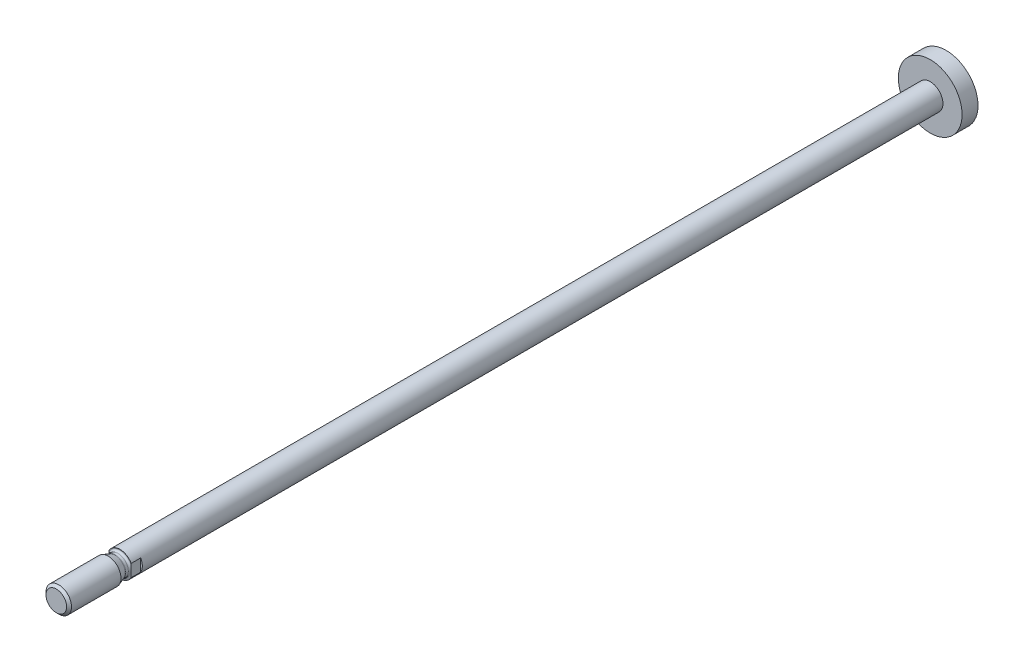
ISO-10303-21;
HEADER;
FILE_DESCRIPTION(('STEP AP214'),'2;1');
FILE_NAME('part.step','',(''),(''),'','','');
FILE_SCHEMA(('AUTOMOTIVE_DESIGN { 1 0 10303 214 1 1 1 1 }'));
ENDSEC;
DATA;
#1=APPLICATION_CONTEXT('core data for automotive mechanical design processes');
#2=APPLICATION_PROTOCOL_DEFINITION('international standard','automotive_design',2000,#1);
#3=PRODUCT_CONTEXT('',#1,'mechanical');
#4=PRODUCT('Part','Part','',(#3));
#5=PRODUCT_RELATED_PRODUCT_CATEGORY('part','',(#4));
#6=PRODUCT_DEFINITION_FORMATION('','',#4);
#7=PRODUCT_DEFINITION_CONTEXT('part definition',#1,'design');
#8=PRODUCT_DEFINITION('design','',#6,#7);
#9=PRODUCT_DEFINITION_SHAPE('','',#8);
#10=(LENGTH_UNIT() NAMED_UNIT(*) SI_UNIT(.MILLI.,.METRE.));
#11=(NAMED_UNIT(*) PLANE_ANGLE_UNIT() SI_UNIT($,.RADIAN.));
#12=(NAMED_UNIT(*) SI_UNIT($,.STERADIAN.) SOLID_ANGLE_UNIT());
#13=UNCERTAINTY_MEASURE_WITH_UNIT(LENGTH_MEASURE(1.E-05),#10,'distance_accuracy_value','');
#14=(GEOMETRIC_REPRESENTATION_CONTEXT(3) GLOBAL_UNCERTAINTY_ASSIGNED_CONTEXT((#13)) GLOBAL_UNIT_ASSIGNED_CONTEXT((#10,
#11,#12)) REPRESENTATION_CONTEXT('',''));
#15=CARTESIAN_POINT('',(0.,0.,0.));
#16=DIRECTION('',(0.,0.,1.));
#17=DIRECTION('',(1.,0.,0.));
#18=AXIS2_PLACEMENT_3D('',#15,#16,#17);
#19=CARTESIAN_POINT('',(0.,0.,4.));
#20=DIRECTION('',(0.,0.,-1.));
#21=DIRECTION('',(-1.,0.,0.));
#22=AXIS2_PLACEMENT_3D('',#19,#20,#21);
#23=PLANE('',#22);
#24=DIRECTION('',(0.,1.,0.));
#25=VECTOR('',#24,1.);
#26=CARTESIAN_POINT('',(-3.5,0.,4.));
#27=LINE('',#26,#25);
#28=CARTESIAN_POINT('',(-3.5,-1.93649167310371,4.));
#29=VERTEX_POINT('',#28);
#30=CARTESIAN_POINT('',(-3.5,-1.47986485869513,4.));
#31=VERTEX_POINT('',#30);
#32=EDGE_CURVE('E51',#29,#31,#27,.T.);
#33=ORIENTED_EDGE('',*,*,#32,.F.);
#34=CARTESIAN_POINT('',(0.,0.,4.));
#35=DIRECTION('',(0.,0.,1.));
#36=DIRECTION('',(1.,0.,0.));
#37=AXIS2_PLACEMENT_3D('',#34,#35,#36);
#38=CIRCLE('',#37,4.);
#39=CARTESIAN_POINT('',(3.5,-1.93649167310371,4.));
#40=VERTEX_POINT('',#39);
#41=EDGE_CURVE('E144',#29,#40,#38,.T.);
#42=ORIENTED_EDGE('',*,*,#41,.T.);
#43=DIRECTION('',(0.,-1.,0.));
#44=VECTOR('',#43,1.);
#45=CARTESIAN_POINT('',(3.5,0.,4.));
#46=LINE('',#45,#44);
#47=CARTESIAN_POINT('',(3.5,-1.47986485869513,3.99999999999992));
#48=VERTEX_POINT('',#47);
#49=EDGE_CURVE('E98',#48,#40,#46,.T.);
#50=ORIENTED_EDGE('',*,*,#49,.F.);
#51=CARTESIAN_POINT('',(0.,0.,4.));
#52=DIRECTION('',(0.,0.,1.));
#53=DIRECTION('',(1.,0.,0.));
#54=AXIS2_PLACEMENT_3D('',#51,#52,#53);
#55=CIRCLE('',#54,3.8000000000001);
#56=EDGE_CURVE('E146',#31,#48,#55,.T.);
#57=ORIENTED_EDGE('',*,*,#56,.F.);
#58=EDGE_LOOP('',(#33,#42,#50,#57));
#59=FACE_BOUND('',#58,.T.);
#60=ADVANCED_FACE('F37',(#59),#23,.F.);
#61=CARTESIAN_POINT('',(-3.5,1.47986485869513,3.99999999999992));
#62=VERTEX_POINT('',#61);
#63=CARTESIAN_POINT('',(-3.5,1.93649167310371,4.));
#64=VERTEX_POINT('',#63);
#65=EDGE_CURVE('E107',#62,#64,#27,.T.);
#66=ORIENTED_EDGE('',*,*,#65,.F.);
#67=CARTESIAN_POINT('',(3.5,1.47986485869513,4.));
#68=VERTEX_POINT('',#67);
#69=EDGE_CURVE('E147',#68,#62,#55,.T.);
#70=ORIENTED_EDGE('',*,*,#69,.F.);
#71=CARTESIAN_POINT('',(3.5,1.93649167310371,4.));
#72=VERTEX_POINT('',#71);
#73=EDGE_CURVE('E59',#72,#68,#46,.T.);
#74=ORIENTED_EDGE('',*,*,#73,.F.);
#75=EDGE_CURVE('E106',#72,#64,#38,.T.);
#76=ORIENTED_EDGE('',*,*,#75,.T.);
#77=EDGE_LOOP('',(#66,#70,#74,#76));
#78=FACE_BOUND('',#77,.T.);
#79=ADVANCED_FACE('F201',(#78),#23,.F.);
#80=CARTESIAN_POINT('',(0.,0.,-255.3));
#81=DIRECTION('',(0.,0.,1.));
#82=DIRECTION('',(1.,0.,0.));
#83=AXIS2_PLACEMENT_3D('',#80,#81,#82);
#84=CYLINDRICAL_SURFACE('',#83,4.);
#85=CARTESIAN_POINT('',(0.,0.,-250.3));
#86=DIRECTION('',(0.,0.,1.));
#87=DIRECTION('',(1.,0.,0.));
#88=AXIS2_PLACEMENT_3D('',#85,#86,#87);
#89=CIRCLE('',#88,4.);
#90=CARTESIAN_POINT('',(4.,0.,-250.3));
#91=VERTEX_POINT('',#90);
#92=EDGE_CURVE('E141',#91,#91,#89,.T.);
#93=ORIENTED_EDGE('',*,*,#92,.T.);
#94=EDGE_LOOP('',(#93));
#95=FACE_BOUND('',#94,.T.);
#96=DIRECTION('',(0.,0.,1.));
#97=VECTOR('',#96,1.);
#98=CARTESIAN_POINT('',(-3.5,-1.93649167310371,-255.3));
#99=LINE('',#98,#97);
#100=CARTESIAN_POINT('',(-3.5,-1.93649167310371,1.));
#101=VERTEX_POINT('',#100);
#102=EDGE_CURVE('E115',#101,#29,#99,.T.);
#103=ORIENTED_EDGE('',*,*,#102,.F.);
#104=CARTESIAN_POINT('',(0.,0.,1.));
#105=DIRECTION('',(0.,0.,1.));
#106=DIRECTION('',(1.,0.,0.));
#107=AXIS2_PLACEMENT_3D('',#104,#105,#106);
#108=CIRCLE('',#107,4.);
#109=CARTESIAN_POINT('',(-3.5,1.93649167310371,1.));
#110=VERTEX_POINT('',#109);
#111=EDGE_CURVE('E11',#110,#101,#108,.T.);
#112=ORIENTED_EDGE('',*,*,#111,.F.);
#113=DIRECTION('',(0.,0.,1.));
#114=VECTOR('',#113,1.);
#115=CARTESIAN_POINT('',(-3.5,1.93649167310371,-255.3));
#116=LINE('',#115,#114);
#117=EDGE_CURVE('E113',#64,#110,#116,.F.);
#118=ORIENTED_EDGE('',*,*,#117,.F.);
#119=ORIENTED_EDGE('',*,*,#75,.F.);
#120=DIRECTION('',(0.,0.,1.));
#121=VECTOR('',#120,1.);
#122=CARTESIAN_POINT('',(3.5,1.93649167310371,-255.3));
#123=LINE('',#122,#121);
#124=CARTESIAN_POINT('',(3.5,1.93649167310371,1.));
#125=VERTEX_POINT('',#124);
#126=EDGE_CURVE('E96',#125,#72,#123,.T.);
#127=ORIENTED_EDGE('',*,*,#126,.F.);
#128=CARTESIAN_POINT('',(3.5,-1.93649167310371,1.));
#129=VERTEX_POINT('',#128);
#130=EDGE_CURVE('E40',#129,#125,#108,.T.);
#131=ORIENTED_EDGE('',*,*,#130,.F.);
#132=DIRECTION('',(0.,0.,1.));
#133=VECTOR('',#132,1.);
#134=CARTESIAN_POINT('',(3.5,-1.93649167310371,-255.3));
#135=LINE('',#134,#133);
#136=EDGE_CURVE('E97',#40,#129,#135,.F.);
#137=ORIENTED_EDGE('',*,*,#136,.F.);
#138=ORIENTED_EDGE('',*,*,#41,.F.);
#139=EDGE_LOOP('',(#103,#112,#118,#119,#127,#131,#137,#138));
#140=FACE_BOUND('',#139,.T.);
#141=ADVANCED_FACE('F103',(#95,#140),#84,.T.);
#142=CARTESIAN_POINT('',(0.,0.,4.6000000000001));
#143=DIRECTION('',(0.,0.,1.));
#144=DIRECTION('',(1.,0.,0.));
#145=AXIS2_PLACEMENT_3D('',#142,#143,#144);
#146=TOROIDAL_SURFACE('',#145,3.8000000000001,0.600000000000099);
#147=CARTESIAN_POINT('',(0.,0.,4.6));
#148=DIRECTION('',(0.,0.,1.));
#149=DIRECTION('',(1.,0.,0.));
#150=AXIS2_PLACEMENT_3D('',#147,#148,#149);
#151=CIRCLE('',#150,3.2);
#152=CARTESIAN_POINT('',(3.2,0.,4.6));
#153=VERTEX_POINT('',#152);
#154=EDGE_CURVE('E132',#153,#153,#151,.T.);
#155=ORIENTED_EDGE('',*,*,#154,.F.);
#156=EDGE_LOOP('',(#155));
#157=FACE_BOUND('',#156,.T.);
#158=CARTESIAN_POINT('',(-3.5,0.,4.08038475772938));
#159=CARTESIAN_POINT('',(-3.5,0.0500062055653644,4.08038579524003));
#160=CARTESIAN_POINT('',(-3.5,0.10001186907905,4.07976142660828));
#161=CARTESIAN_POINT('',(-3.5,0.200008073579427,4.07732415974821));
#162=CARTESIAN_POINT('',(-3.5,0.249998606009498,4.07551091782565));
#163=CARTESIAN_POINT('',(-3.5,0.350023676666661,4.0708553451476));
#164=CARTESIAN_POINT('',(-3.5,0.400058122823757,4.06801109956585));
#165=CARTESIAN_POINT('',(-3.5,0.500067954430721,4.06154909714063));
#166=CARTESIAN_POINT('',(-3.5,0.550043347826766,4.05793146015032));
#167=CARTESIAN_POINT('',(-3.5,0.690839508563253,4.04708094798961));
#168=CARTESIAN_POINT('',(-3.5,0.781617050076563,4.03931230060361));
#169=CARTESIAN_POINT('',(-3.5,0.9632220149238,4.024401341373));
#170=CARTESIAN_POINT('',(-3.5,1.05404943604569,4.01725900370584));
#171=CARTESIAN_POINT('',(-3.5,1.2359337458161,4.00596554667804));
#172=CARTESIAN_POINT('',(-3.5,1.32699066193964,4.00181480438343));
#173=CARTESIAN_POINT('',(-3.5,1.50913050906379,3.99911696420226));
#174=CARTESIAN_POINT('',(-3.5,1.60021331380939,4.00056402453771));
#175=CARTESIAN_POINT('',(-3.5,1.7832512039485,4.01223826838346));
#176=CARTESIAN_POINT('',(-3.5,1.87520111900955,4.02258560378902));
#177=CARTESIAN_POINT('',(-3.5,2.01109807868235,4.04805353771768));
#178=CARTESIAN_POINT('',(-3.5,2.05597275422268,4.05817105079477));
#179=CARTESIAN_POINT('',(-3.5,2.1446015872334,4.08243134215497));
#180=CARTESIAN_POINT('',(-3.5,2.18835703510382,4.09656923395692));
#181=CARTESIAN_POINT('',(-3.5,2.26502423932735,4.12625619760487));
#182=CARTESIAN_POINT('',(-3.5,2.29828717281195,4.14088897580844));
#183=CARTESIAN_POINT('',(-3.5,2.36308366134456,4.17374487362841));
#184=CARTESIAN_POINT('',(-3.5,2.39461486317948,4.1919727313804));
#185=CARTESIAN_POINT('',(-3.5,2.45528633475527,4.2327718563323));
#186=CARTESIAN_POINT('',(-3.5,2.48439672100251,4.25538839857406));
#187=CARTESIAN_POINT('',(-3.5,2.53828325245288,4.30531204058377));
#188=CARTESIAN_POINT('',(-3.5,2.56307231252292,4.33260466298422));
#189=CARTESIAN_POINT('',(-3.5,2.59835539678092,4.38117119923997));
#190=CARTESIAN_POINT('',(-3.5,2.61077480767077,4.40104374871059));
#191=CARTESIAN_POINT('',(-3.5,2.63229473049418,4.44252572441527));
#192=CARTESIAN_POINT('',(-3.5,2.64139766596252,4.4641338682032));
#193=CARTESIAN_POINT('',(-3.5,2.6556780834849,4.50882581532605));
#194=CARTESIAN_POINT('',(-3.5,2.66082330977963,4.53192011572204));
#195=CARTESIAN_POINT('',(-3.5,2.66658722454624,4.57866774033149));
#196=CARTESIAN_POINT('',(-3.5,2.66720861100635,4.60232072290385));
#197=CARTESIAN_POINT('',(-3.5,2.66406334493496,4.64664399355305));
#198=CARTESIAN_POINT('',(-3.5,2.66078189261244,4.66735080097796));
#199=CARTESIAN_POINT('',(-3.5,2.65086769882215,4.70793958933708));
#200=CARTESIAN_POINT('',(-3.5,2.64423425840105,4.72782139730718));
#201=CARTESIAN_POINT('',(-3.5,2.62783818542989,4.76683694228269));
#202=CARTESIAN_POINT('',(-3.5,2.61799948146632,4.78593830149638));
#203=CARTESIAN_POINT('',(-3.5,2.5957864239932,4.8225893297694));
#204=CARTESIAN_POINT('',(-3.5,2.58341098566742,4.84013833036213));
#205=CARTESIAN_POINT('',(-3.5,2.54827666077279,4.88403391197271));
#206=CARTESIAN_POINT('',(-3.5,2.52385245228452,4.90904933157706));
#207=CARTESIAN_POINT('',(-3.5,2.4713802477796,4.95494570673838));
#208=CARTESIAN_POINT('',(-3.5,2.44332184293567,4.97581433256553));
#209=CARTESIAN_POINT('',(-3.5,2.36690919769617,5.02546583684508));
#210=CARTESIAN_POINT('',(-3.5,2.31664003371327,5.05127975894021));
#211=CARTESIAN_POINT('',(-3.5,2.21292774859494,5.09519868885441));
#212=CARTESIAN_POINT('',(-3.5,2.15947928807564,5.11329028588226));
#213=CARTESIAN_POINT('',(-3.5,2.05241854459677,5.14298422713627));
#214=CARTESIAN_POINT('',(-3.5,1.99885008338122,5.15474937556394));
#215=CARTESIAN_POINT('',(-3.5,1.89088555933464,5.17371645891197));
#216=CARTESIAN_POINT('',(-3.5,1.83648865462849,5.18091338377391));
#217=CARTESIAN_POINT('',(-3.5,1.72719420827212,5.19169636188153));
#218=CARTESIAN_POINT('',(-3.5,1.67229565989963,5.19527163434467));
#219=CARTESIAN_POINT('',(-3.5,1.56237784754192,5.19956192851468));
#220=CARTESIAN_POINT('',(-3.5,1.50735854591716,5.20027587383621));
#221=CARTESIAN_POINT('',(-3.5,1.32143089044828,5.19902509431349));
#222=CARTESIAN_POINT('',(-3.5,1.19058803810505,5.1920033327333));
#223=CARTESIAN_POINT('',(-3.5,0.929144323978893,5.17339442832176));
#224=CARTESIAN_POINT('',(-3.5,0.798544182549121,5.161800011167));
#225=CARTESIAN_POINT('',(-3.5,0.602747235241971,5.14602809613734));
#226=CARTESIAN_POINT('',(-3.5,0.537627510492783,5.14104900273235));
#227=CARTESIAN_POINT('',(-3.5,0.407306821786678,5.1323371224062));
#228=CARTESIAN_POINT('',(-3.5,0.342105863988336,5.1286042461649));
#229=CARTESIAN_POINT('',(-3.5,0.211728862091437,5.1229526202353));
#230=CARTESIAN_POINT('',(-3.5,0.146552955128154,5.1210308804655));
#231=CARTESIAN_POINT('',(-3.5,0.0161730194372509,5.11928917221939));
#232=CARTESIAN_POINT('',(-3.5,-0.0490310086083378,5.11946915535245));
#233=CARTESIAN_POINT('',(-3.5,-0.179475576502579,5.12190517622444));
#234=CARTESIAN_POINT('',(-3.5,-0.244716066981349,5.12416369265122));
#235=CARTESIAN_POINT('',(-3.5,-0.375115910587606,5.13040554579892));
#236=CARTESIAN_POINT('',(-3.5,-0.440275258610719,5.13438898602551));
#237=CARTESIAN_POINT('',(-3.5,-0.635895337566246,5.14807827632179));
#238=CARTESIAN_POINT('',(-3.5,-0.76621884732944,5.15951342405818));
#239=CARTESIAN_POINT('',(-3.5,-1.02713131334285,5.18073972163101));
#240=CARTESIAN_POINT('',(-3.5,-1.15772038871775,5.19052976890211));
#241=CARTESIAN_POINT('',(-3.5,-1.35378409785631,5.19852164600105));
#242=CARTESIAN_POINT('',(-3.5,-1.41909161309346,5.2000721709194));
#243=CARTESIAN_POINT('',(-3.5,-1.54969188303483,5.19992263560432));
#244=CARTESIAN_POINT('',(-3.5,-1.61498463760302,5.19822333879744));
#245=CARTESIAN_POINT('',(-3.5,-1.76029290673312,5.18951322581212));
#246=CARTESIAN_POINT('',(-3.5,-1.84025983788535,5.18137635704226));
#247=CARTESIAN_POINT('',(-3.5,-1.95903476517147,5.16210189637695));
#248=CARTESIAN_POINT('',(-3.5,-1.99841540324246,5.15450321251105));
#249=CARTESIAN_POINT('',(-3.5,-2.07652038986955,5.13650653853808));
#250=CARTESIAN_POINT('',(-3.5,-2.11524511477409,5.12611021577707));
#251=CARTESIAN_POINT('',(-3.5,-2.19864889359521,5.0998048910277));
#252=CARTESIAN_POINT('',(-3.5,-2.24312539757502,5.08323620538603));
#253=CARTESIAN_POINT('',(-3.5,-2.32958676042036,5.04443385186534));
#254=CARTESIAN_POINT('',(-3.5,-2.37157403081922,5.022205781053));
#255=CARTESIAN_POINT('',(-3.5,-2.43977528813279,4.97826900973618));
#256=CARTESIAN_POINT('',(-3.5,-2.46706045695041,4.95823818276675));
#257=CARTESIAN_POINT('',(-3.5,-2.51831793755153,4.91428859212922));
#258=CARTESIAN_POINT('',(-3.5,-2.54229604965639,4.89037680000235));
#259=CARTESIAN_POINT('',(-3.5,-2.57970363739195,4.84535217347594));
#260=CARTESIAN_POINT('',(-3.5,-2.59424612037896,4.82517000607983));
#261=CARTESIAN_POINT('',(-3.5,-2.61992505476884,4.78272143024207));
#262=CARTESIAN_POINT('',(-3.5,-2.63106349643882,4.76045624967719));
#263=CARTESIAN_POINT('',(-3.5,-2.64920025698533,4.7140036601898));
#264=CARTESIAN_POINT('',(-3.5,-2.65615513895816,4.68979894460471));
#265=CARTESIAN_POINT('',(-3.5,-2.66504809529779,4.64048613942947));
#266=CARTESIAN_POINT('',(-3.5,-2.66699167521719,4.61537907197386));
#267=CARTESIAN_POINT('',(-3.5,-2.66576972792539,4.56913838413921));
#268=CARTESIAN_POINT('',(-3.5,-2.66333713024049,4.54798188760978));
#269=CARTESIAN_POINT('',(-3.5,-2.65493122425014,4.50638930411087));
#270=CARTESIAN_POINT('',(-3.5,-2.6489573784939,4.4859533269926));
#271=CARTESIAN_POINT('',(-3.5,-2.63391040496586,4.44635032544822));
#272=CARTESIAN_POINT('',(-3.5,-2.62484735225162,4.42717941476791));
#273=CARTESIAN_POINT('',(-3.5,-2.60412982714912,4.39030840624931));
#274=CARTESIAN_POINT('',(-3.5,-2.59247439145874,4.37260885852133));
#275=CARTESIAN_POINT('',(-3.5,-2.55964651342061,4.32891810073296));
#276=CARTESIAN_POINT('',(-3.5,-2.53688962871665,4.30411605633953));
#277=CARTESIAN_POINT('',(-3.5,-2.48775025498198,4.25840323881892));
#278=CARTESIAN_POINT('',(-3.5,-2.46135776993871,4.2375035818933));
#279=CARTESIAN_POINT('',(-3.5,-2.38986954756856,4.18798307162582));
#280=CARTESIAN_POINT('',(-3.5,-2.34291429622141,4.16206577415089));
#281=CARTESIAN_POINT('',(-3.5,-2.24574558542675,4.11749887118979));
#282=CARTESIAN_POINT('',(-3.5,-2.19552624943271,4.09886282247383));
#283=CARTESIAN_POINT('',(-3.5,-2.09587462128469,4.06817578766957));
#284=CARTESIAN_POINT('',(-3.5,-2.04652620992952,4.05584474254379));
#285=CARTESIAN_POINT('',(-3.5,-1.94693895896851,4.0354159388682));
#286=CARTESIAN_POINT('',(-3.5,-1.89669924688715,4.02732259522156));
#287=CARTESIAN_POINT('',(-3.5,-1.74513146101115,4.00812320842939));
#288=CARTESIAN_POINT('',(-3.5,-1.64316995649346,4.00215511449531));
#289=CARTESIAN_POINT('',(-3.5,-1.41246700498561,3.99839333626015));
#290=CARTESIAN_POINT('',(-3.5,-1.28373629994329,4.00316287285656));
#291=CARTESIAN_POINT('',(-3.5,-1.02661753839385,4.01880990476259));
#292=CARTESIAN_POINT('',(-3.5,-0.898230000845064,4.0296939787844));
#293=CARTESIAN_POINT('',(-3.5,-0.705746127745405,4.04568170858882));
#294=CARTESIAN_POINT('',(-3.5,-0.641662853121003,4.05094963535158));
#295=CARTESIAN_POINT('',(-3.5,-0.513433811524688,4.06064102594273));
#296=CARTESIAN_POINT('',(-3.5,-0.449288049445188,4.06506455125933));
#297=CARTESIAN_POINT('',(-3.5,-0.32098353941607,4.07243012154035));
#298=CARTESIAN_POINT('',(-3.5,-0.256824896504214,4.07537391204972));
#299=CARTESIAN_POINT('',(-3.5,-0.128443871708583,4.07935057895739));
#300=CARTESIAN_POINT('',(-3.5,-0.0642214888377097,4.08038342528518));
#301=CARTESIAN_POINT('',(-3.5,0.,4.08038475772938));
#302=B_SPLINE_CURVE_WITH_KNOTS('',3,(#158,#159,#160,#161,#162,#163,#164,#165,#166,#167,#168,
#169,#170,#171,#172,#173,#174,#175,#176,#177,#178,#179,#180,#181,#182,#183,#184,#185,#186,#187,
#188,#189,#190,#191,#192,#193,#194,#195,#196,#197,#198,#199,#200,#201,#202,#203,#204,#205,#206,
#207,#208,#209,#210,#211,#212,#213,#214,#215,#216,#217,#218,#219,#220,#221,#222,#223,#224,#225,
#226,#227,#228,#229,#230,#231,#232,#233,#234,#235,#236,#237,#238,#239,#240,#241,#242,#243,#244,
#245,#246,#247,#248,#249,#250,#251,#252,#253,#254,#255,#256,#257,#258,#259,#260,#261,#262,#263,
#264,#265,#266,#267,#268,#269,#270,#271,#272,#273,#274,#275,#276,#277,#278,#279,#280,#281,#282,
#283,#284,#285,#286,#287,#288,#289,#290,#291,#292,#293,#294,#295,#296,#297,#298,#299,#300,#301),
.UNSPECIFIED.,.T.,.F.,(4,2,2,2,2,2,2,2,2,2,2,2,2,2,2,2,2,2,2,2,2,2,2,2,2,2,2,2,2,2,2,2,2,2,2,2,
2,2,2,2,2,2,2,2,2,2,2,2,2,2,2,2,2,2,2,2,2,2,2,2,2,2,2,2,2,2,2,2,2,2,2,4),(0.,0.150014048798422,
0.300071484653546,0.450409053935331,0.600723342136289,0.874049825720873,1.14736503484109,
1.42071468707779,1.69377915294987,1.97058884479861,2.10845216776641,2.2461486387614,
2.35499514952082,2.46398608488314,2.57416771557531,2.68401418736232,2.75406745328572,
2.8240694241867,2.89463604494047,2.96516057677686,3.02776088906933,3.09037426010844,
3.15459752456243,3.21884831114799,3.32313116232507,3.42771958650061,3.59629393435684,
3.76515985338398,3.92944239010749,4.09390478874738,4.25885532608726,4.42386790935157,
4.81662747336841,5.21001438834882,5.4059342565683,5.60184007960282,5.79742190395237,
5.99299922518425,6.18881007848093,6.38463268321895,6.77711538137523,7.16986008579766,
7.36577121673005,7.56163633117303,7.80230390131153,7.92254416345271,8.04271292251144,
8.18480424522089,8.32675558344215,8.42801297124486,8.5290904393555,8.60345225460728,
8.67777050861516,8.75284763934138,8.82784225307812,8.89141694017011,8.95500127838402,
9.01838019760285,9.08178270722154,9.1821864562108,9.28287198824411,9.44286612854139,
9.60315675421254,9.75552106026109,9.90804378754775,10.2137509318015,10.5998737561413,
10.9864128129893,11.1793105025674,11.372194140224,11.5648497087301,11.7575083088275),.UNSPECIFIED.);
#303=EDGE_CURVE('E94',#31,#62,#302,.T.);
#304=ORIENTED_EDGE('',*,*,#303,.F.);
#305=ORIENTED_EDGE('',*,*,#56,.T.);
#306=CARTESIAN_POINT('',(3.5,0.,4.08038475772938));
#307=CARTESIAN_POINT('',(3.5,-0.0500062055653644,4.08038579524003));
#308=CARTESIAN_POINT('',(3.5,-0.10001186907905,4.07976142660828));
#309=CARTESIAN_POINT('',(3.5,-0.200008073579427,4.07732415974821));
#310=CARTESIAN_POINT('',(3.5,-0.249998606009498,4.07551091782565));
#311=CARTESIAN_POINT('',(3.5,-0.350023676666661,4.0708553451476));
#312=CARTESIAN_POINT('',(3.5,-0.400058122823757,4.06801109956585));
#313=CARTESIAN_POINT('',(3.5,-0.500067954430721,4.06154909714063));
#314=CARTESIAN_POINT('',(3.5,-0.550043347826766,4.05793146015032));
#315=CARTESIAN_POINT('',(3.5,-0.690839508563253,4.04708094798961));
#316=CARTESIAN_POINT('',(3.5,-0.781617050076563,4.03931230060361));
#317=CARTESIAN_POINT('',(3.5,-0.9632220149238,4.024401341373));
#318=CARTESIAN_POINT('',(3.5,-1.05404943604569,4.01725900370584));
#319=CARTESIAN_POINT('',(3.5,-1.2359337458161,4.00596554667804));
#320=CARTESIAN_POINT('',(3.5,-1.32699066193964,4.00181480438343));
#321=CARTESIAN_POINT('',(3.5,-1.50913050906379,3.99911696420226));
#322=CARTESIAN_POINT('',(3.5,-1.60021331380939,4.00056402453771));
#323=CARTESIAN_POINT('',(3.5,-1.7832512039485,4.01223826838346));
#324=CARTESIAN_POINT('',(3.5,-1.87520111900955,4.02258560378902));
#325=CARTESIAN_POINT('',(3.5,-2.01109807868235,4.04805353771768));
#326=CARTESIAN_POINT('',(3.5,-2.05597275422268,4.05817105079477));
#327=CARTESIAN_POINT('',(3.5,-2.1446015872334,4.08243134215497));
#328=CARTESIAN_POINT('',(3.5,-2.18835703510382,4.09656923395692));
#329=CARTESIAN_POINT('',(3.5,-2.26502423932735,4.12625619760487));
#330=CARTESIAN_POINT('',(3.5,-2.29828717281195,4.14088897580844));
#331=CARTESIAN_POINT('',(3.5,-2.36308366134456,4.17374487362841));
#332=CARTESIAN_POINT('',(3.5,-2.39461486317948,4.1919727313804));
#333=CARTESIAN_POINT('',(3.5,-2.45528633475527,4.2327718563323));
#334=CARTESIAN_POINT('',(3.5,-2.48439672100251,4.25538839857406));
#335=CARTESIAN_POINT('',(3.5,-2.53828325245288,4.30531204058377));
#336=CARTESIAN_POINT('',(3.5,-2.56307231252292,4.33260466298422));
#337=CARTESIAN_POINT('',(3.5,-2.59835539678092,4.38117119923997));
#338=CARTESIAN_POINT('',(3.5,-2.61077480767077,4.40104374871059));
#339=CARTESIAN_POINT('',(3.5,-2.63229473049418,4.44252572441527));
#340=CARTESIAN_POINT('',(3.5,-2.64139766596252,4.4641338682032));
#341=CARTESIAN_POINT('',(3.5,-2.6556780834849,4.50882581532605));
#342=CARTESIAN_POINT('',(3.5,-2.66082330977963,4.53192011572204));
#343=CARTESIAN_POINT('',(3.5,-2.66658722454624,4.57866774033149));
#344=CARTESIAN_POINT('',(3.5,-2.66720861100635,4.60232072290385));
#345=CARTESIAN_POINT('',(3.5,-2.66406334493496,4.64664399355305));
#346=CARTESIAN_POINT('',(3.5,-2.66078189261244,4.66735080097796));
#347=CARTESIAN_POINT('',(3.5,-2.65086769882215,4.70793958933708));
#348=CARTESIAN_POINT('',(3.5,-2.64423425840105,4.72782139730718));
#349=CARTESIAN_POINT('',(3.5,-2.62783818542989,4.76683694228269));
#350=CARTESIAN_POINT('',(3.5,-2.61799948146632,4.78593830149638));
#351=CARTESIAN_POINT('',(3.5,-2.5957864239932,4.8225893297694));
#352=CARTESIAN_POINT('',(3.5,-2.58341098566742,4.84013833036213));
#353=CARTESIAN_POINT('',(3.5,-2.54827666077279,4.88403391197271));
#354=CARTESIAN_POINT('',(3.5,-2.52385245228452,4.90904933157706));
#355=CARTESIAN_POINT('',(3.5,-2.4713802477796,4.95494570673838));
#356=CARTESIAN_POINT('',(3.5,-2.44332184293567,4.97581433256553));
#357=CARTESIAN_POINT('',(3.5,-2.36690919769617,5.02546583684508));
#358=CARTESIAN_POINT('',(3.5,-2.31664003371327,5.05127975894021));
#359=CARTESIAN_POINT('',(3.5,-2.21292774859494,5.09519868885441));
#360=CARTESIAN_POINT('',(3.5,-2.15947928807564,5.11329028588226));
#361=CARTESIAN_POINT('',(3.5,-2.05241854459677,5.14298422713627));
#362=CARTESIAN_POINT('',(3.5,-1.99885008338122,5.15474937556394));
#363=CARTESIAN_POINT('',(3.5,-1.89088555933464,5.17371645891197));
#364=CARTESIAN_POINT('',(3.5,-1.83648865462849,5.18091338377391));
#365=CARTESIAN_POINT('',(3.5,-1.72719420827212,5.19169636188153));
#366=CARTESIAN_POINT('',(3.5,-1.67229565989963,5.19527163434467));
#367=CARTESIAN_POINT('',(3.5,-1.56237784754192,5.19956192851468));
#368=CARTESIAN_POINT('',(3.5,-1.50735854591716,5.20027587383621));
#369=CARTESIAN_POINT('',(3.5,-1.32143089044828,5.19902509431349));
#370=CARTESIAN_POINT('',(3.5,-1.19058803810505,5.1920033327333));
#371=CARTESIAN_POINT('',(3.5,-0.929144323978893,5.17339442832176));
#372=CARTESIAN_POINT('',(3.5,-0.798544182549121,5.161800011167));
#373=CARTESIAN_POINT('',(3.5,-0.602747235241971,5.14602809613734));
#374=CARTESIAN_POINT('',(3.5,-0.537627510492783,5.14104900273235));
#375=CARTESIAN_POINT('',(3.5,-0.407306821786678,5.1323371224062));
#376=CARTESIAN_POINT('',(3.5,-0.342105863988336,5.1286042461649));
#377=CARTESIAN_POINT('',(3.5,-0.211728862091437,5.1229526202353));
#378=CARTESIAN_POINT('',(3.5,-0.146552955128154,5.1210308804655));
#379=CARTESIAN_POINT('',(3.5,-0.0161730194372509,5.11928917221939));
#380=CARTESIAN_POINT('',(3.5,0.0490310086083378,5.11946915535245));
#381=CARTESIAN_POINT('',(3.5,0.179475576502579,5.12190517622444));
#382=CARTESIAN_POINT('',(3.5,0.244716066981349,5.12416369265122));
#383=CARTESIAN_POINT('',(3.5,0.375115910587606,5.13040554579892));
#384=CARTESIAN_POINT('',(3.5,0.440275258610719,5.13438898602551));
#385=CARTESIAN_POINT('',(3.5,0.635895337566246,5.14807827632179));
#386=CARTESIAN_POINT('',(3.5,0.76621884732944,5.15951342405818));
#387=CARTESIAN_POINT('',(3.5,1.02713131334285,5.18073972163101));
#388=CARTESIAN_POINT('',(3.5,1.15772038871775,5.19052976890211));
#389=CARTESIAN_POINT('',(3.5,1.35378409785631,5.19852164600105));
#390=CARTESIAN_POINT('',(3.5,1.41909161309346,5.2000721709194));
#391=CARTESIAN_POINT('',(3.5,1.54969188303483,5.19992263560432));
#392=CARTESIAN_POINT('',(3.5,1.61498463760302,5.19822333879744));
#393=CARTESIAN_POINT('',(3.5,1.76029290673312,5.18951322581212));
#394=CARTESIAN_POINT('',(3.5,1.84025983788535,5.18137635704226));
#395=CARTESIAN_POINT('',(3.5,1.95903476517147,5.16210189637695));
#396=CARTESIAN_POINT('',(3.5,1.99841540324246,5.15450321251105));
#397=CARTESIAN_POINT('',(3.5,2.07652038986955,5.13650653853808));
#398=CARTESIAN_POINT('',(3.5,2.11524511477409,5.12611021577707));
#399=CARTESIAN_POINT('',(3.5,2.19864889359521,5.0998048910277));
#400=CARTESIAN_POINT('',(3.5,2.24312539757502,5.08323620538603));
#401=CARTESIAN_POINT('',(3.5,2.32958676042036,5.04443385186534));
#402=CARTESIAN_POINT('',(3.5,2.37157403081922,5.022205781053));
#403=CARTESIAN_POINT('',(3.5,2.43977528813279,4.97826900973618));
#404=CARTESIAN_POINT('',(3.5,2.46706045695041,4.95823818276675));
#405=CARTESIAN_POINT('',(3.5,2.51831793755153,4.91428859212922));
#406=CARTESIAN_POINT('',(3.5,2.54229604965639,4.89037680000235));
#407=CARTESIAN_POINT('',(3.5,2.57970363739195,4.84535217347594));
#408=CARTESIAN_POINT('',(3.5,2.59424612037896,4.82517000607983));
#409=CARTESIAN_POINT('',(3.5,2.61992505476884,4.78272143024207));
#410=CARTESIAN_POINT('',(3.5,2.63106349643882,4.76045624967719));
#411=CARTESIAN_POINT('',(3.5,2.64920025698533,4.7140036601898));
#412=CARTESIAN_POINT('',(3.5,2.65615513895816,4.68979894460471));
#413=CARTESIAN_POINT('',(3.5,2.66504809529779,4.64048613942947));
#414=CARTESIAN_POINT('',(3.5,2.66699167521719,4.61537907197386));
#415=CARTESIAN_POINT('',(3.5,2.66576972792539,4.56913838413921));
#416=CARTESIAN_POINT('',(3.5,2.66333713024049,4.54798188760978));
#417=CARTESIAN_POINT('',(3.5,2.65493122425014,4.50638930411087));
#418=CARTESIAN_POINT('',(3.5,2.6489573784939,4.4859533269926));
#419=CARTESIAN_POINT('',(3.5,2.63391040496586,4.44635032544822));
#420=CARTESIAN_POINT('',(3.5,2.62484735225162,4.42717941476791));
#421=CARTESIAN_POINT('',(3.5,2.60412982714912,4.39030840624931));
#422=CARTESIAN_POINT('',(3.5,2.59247439145874,4.37260885852133));
#423=CARTESIAN_POINT('',(3.5,2.55964651342061,4.32891810073296));
#424=CARTESIAN_POINT('',(3.5,2.53688962871665,4.30411605633953));
#425=CARTESIAN_POINT('',(3.5,2.48775025498198,4.25840323881892));
#426=CARTESIAN_POINT('',(3.5,2.46135776993871,4.2375035818933));
#427=CARTESIAN_POINT('',(3.5,2.38986954756856,4.18798307162582));
#428=CARTESIAN_POINT('',(3.5,2.34291429622141,4.16206577415089));
#429=CARTESIAN_POINT('',(3.5,2.24574558542675,4.11749887118979));
#430=CARTESIAN_POINT('',(3.5,2.19552624943271,4.09886282247383));
#431=CARTESIAN_POINT('',(3.5,2.09587462128469,4.06817578766957));
#432=CARTESIAN_POINT('',(3.5,2.04652620992952,4.05584474254379));
#433=CARTESIAN_POINT('',(3.5,1.94693895896851,4.0354159388682));
#434=CARTESIAN_POINT('',(3.5,1.89669924688715,4.02732259522156));
#435=CARTESIAN_POINT('',(3.5,1.74513146101115,4.00812320842939));
#436=CARTESIAN_POINT('',(3.5,1.64316995649346,4.00215511449531));
#437=CARTESIAN_POINT('',(3.5,1.41246700498561,3.99839333626015));
#438=CARTESIAN_POINT('',(3.5,1.28373629994329,4.00316287285656));
#439=CARTESIAN_POINT('',(3.5,1.02661753839385,4.01880990476259));
#440=CARTESIAN_POINT('',(3.5,0.898230000845064,4.0296939787844));
#441=CARTESIAN_POINT('',(3.5,0.705746127745405,4.04568170858882));
#442=CARTESIAN_POINT('',(3.5,0.641662853121003,4.05094963535158));
#443=CARTESIAN_POINT('',(3.5,0.513433811524688,4.06064102594273));
#444=CARTESIAN_POINT('',(3.5,0.449288049445188,4.06506455125933));
#445=CARTESIAN_POINT('',(3.5,0.32098353941607,4.07243012154035));
#446=CARTESIAN_POINT('',(3.5,0.256824896504214,4.07537391204972));
#447=CARTESIAN_POINT('',(3.5,0.128443871708583,4.07935057895739));
#448=CARTESIAN_POINT('',(3.5,0.0642214888377097,4.08038342528518));
#449=CARTESIAN_POINT('',(3.5,0.,4.08038475772938));
#450=B_SPLINE_CURVE_WITH_KNOTS('',3,(#306,#307,#308,#309,#310,#311,#312,#313,#314,#315,#316,
#317,#318,#319,#320,#321,#322,#323,#324,#325,#326,#327,#328,#329,#330,#331,#332,#333,#334,#335,
#336,#337,#338,#339,#340,#341,#342,#343,#344,#345,#346,#347,#348,#349,#350,#351,#352,#353,#354,
#355,#356,#357,#358,#359,#360,#361,#362,#363,#364,#365,#366,#367,#368,#369,#370,#371,#372,#373,
#374,#375,#376,#377,#378,#379,#380,#381,#382,#383,#384,#385,#386,#387,#388,#389,#390,#391,#392,
#393,#394,#395,#396,#397,#398,#399,#400,#401,#402,#403,#404,#405,#406,#407,#408,#409,#410,#411,
#412,#413,#414,#415,#416,#417,#418,#419,#420,#421,#422,#423,#424,#425,#426,#427,#428,#429,#430,
#431,#432,#433,#434,#435,#436,#437,#438,#439,#440,#441,#442,#443,#444,#445,#446,#447,#448,#449),
.UNSPECIFIED.,.T.,.F.,(4,2,2,2,2,2,2,2,2,2,2,2,2,2,2,2,2,2,2,2,2,2,2,2,2,2,2,2,2,2,2,2,2,2,2,2,
2,2,2,2,2,2,2,2,2,2,2,2,2,2,2,2,2,2,2,2,2,2,2,2,2,2,2,2,2,2,2,2,2,2,2,4),(0.,0.150014048798422,
0.300071484653546,0.450409053935331,0.600723342136289,0.874049825720873,1.14736503484109,
1.42071468707779,1.69377915294987,1.97058884479861,2.10845216776641,2.2461486387614,
2.35499514952082,2.46398608488314,2.57416771557531,2.68401418736232,2.75406745328572,
2.8240694241867,2.89463604494047,2.96516057677686,3.02776088906933,3.09037426010844,
3.15459752456243,3.21884831114799,3.32313116232507,3.42771958650061,3.59629393435684,
3.76515985338398,3.92944239010749,4.09390478874738,4.25885532608726,4.42386790935157,
4.81662747336841,5.21001438834882,5.4059342565683,5.60184007960282,5.79742190395237,
5.99299922518425,6.18881007848093,6.38463268321895,6.77711538137523,7.16986008579766,
7.36577121673005,7.56163633117303,7.80230390131153,7.92254416345271,8.04271292251144,
8.18480424522089,8.32675558344215,8.42801297124486,8.5290904393555,8.60345225460728,
8.67777050861516,8.75284763934138,8.82784225307812,8.89141694017011,8.95500127838402,
9.01838019760285,9.08178270722154,9.1821864562108,9.28287198824411,9.44286612854139,
9.60315675421254,9.75552106026109,9.90804378754775,10.2137509318015,10.5998737561413,
10.9864128129893,11.1793105025674,11.372194140224,11.5648497087301,11.7575083088275),.UNSPECIFIED.);
#451=EDGE_CURVE('E150',#68,#48,#450,.T.);
#452=ORIENTED_EDGE('',*,*,#451,.F.);
#453=ORIENTED_EDGE('',*,*,#69,.T.);
#454=EDGE_LOOP('',(#304,#305,#452,#453));
#455=FACE_BOUND('',#454,.T.);
#456=ADVANCED_FACE('F158',(#157,#455),#146,.F.);
#457=CARTESIAN_POINT('',(0.,4.,-250.3));
#458=DIRECTION('',(0.,0.,-1.));
#459=DIRECTION('',(-1.,0.,0.));
#460=AXIS2_PLACEMENT_3D('',#457,#458,#459);
#461=PLANE('',#460);
#462=ORIENTED_EDGE('',*,*,#92,.F.);
#463=EDGE_LOOP('',(#462));
#464=FACE_BOUND('',#463,.T.);
#465=CARTESIAN_POINT('',(0.,0.,-250.3));
#466=DIRECTION('',(0.,0.,1.));
#467=DIRECTION('',(1.,0.,0.));
#468=AXIS2_PLACEMENT_3D('',#465,#466,#467);
#469=CIRCLE('',#468,10.);
#470=CARTESIAN_POINT('',(10.,0.,-250.3));
#471=VERTEX_POINT('',#470);
#472=EDGE_CURVE('E138',#471,#471,#469,.T.);
#473=ORIENTED_EDGE('',*,*,#472,.T.);
#474=EDGE_LOOP('',(#473));
#475=FACE_BOUND('',#474,.T.);
#476=ADVANCED_FACE('F221',(#464,#475),#461,.F.);
#477=CARTESIAN_POINT('',(0.,0.,-255.3));
#478=DIRECTION('',(0.,0.,1.));
#479=DIRECTION('',(1.,0.,0.));
#480=AXIS2_PLACEMENT_3D('',#477,#478,#479);
#481=CYLINDRICAL_SURFACE('',#480,10.);
#482=ORIENTED_EDGE('',*,*,#472,.F.);
#483=EDGE_LOOP('',(#482));
#484=FACE_BOUND('',#483,.T.);
#485=CARTESIAN_POINT('',(0.,0.,-255.3));
#486=DIRECTION('',(0.,0.,1.));
#487=DIRECTION('',(1.,0.,0.));
#488=AXIS2_PLACEMENT_3D('',#485,#486,#487);
#489=CIRCLE('',#488,10.);
#490=CARTESIAN_POINT('',(10.,0.,-255.3));
#491=VERTEX_POINT('',#490);
#492=EDGE_CURVE('E135',#491,#491,#489,.T.);
#493=ORIENTED_EDGE('',*,*,#492,.T.);
#494=EDGE_LOOP('',(#493));
#495=FACE_BOUND('',#494,.T.);
#496=ADVANCED_FACE('F196',(#484,#495),#481,.T.);
#497=CARTESIAN_POINT('',(0.,10.,-255.3));
#498=DIRECTION('',(0.,0.,1.));
#499=DIRECTION('',(1.,0.,0.));
#500=AXIS2_PLACEMENT_3D('',#497,#498,#499);
#501=PLANE('',#500);
#502=ORIENTED_EDGE('',*,*,#492,.F.);
#503=EDGE_LOOP('',(#502));
#504=FACE_BOUND('',#503,.T.);
#505=ADVANCED_FACE('F191',(#504),#501,.F.);
#506=CARTESIAN_POINT('',(0.,0.,3.));
#507=DIRECTION('',(0.,0.,1.));
#508=DIRECTION('',(1.,0.,0.));
#509=AXIS2_PLACEMENT_3D('',#506,#507,#508);
#510=CYLINDRICAL_SURFACE('',#509,3.2);
#511=CARTESIAN_POINT('',(0.,0.,5.3942038115749));
#512=DIRECTION('',(0.,0.,1.));
#513=DIRECTION('',(1.,0.,0.));
#514=AXIS2_PLACEMENT_3D('',#511,#512,#513);
#515=CIRCLE('',#514,3.2);
#516=CARTESIAN_POINT('',(3.2,0.,5.3942038115749));
#517=VERTEX_POINT('',#516);
#518=EDGE_CURVE('E129',#517,#517,#515,.T.);
#519=ORIENTED_EDGE('',*,*,#518,.F.);
#520=EDGE_LOOP('',(#519));
#521=FACE_BOUND('',#520,.T.);
#522=ORIENTED_EDGE('',*,*,#154,.T.);
#523=EDGE_LOOP('',(#522));
#524=FACE_BOUND('',#523,.T.);
#525=ADVANCED_FACE('F188',(#521,#524),#510,.T.);
#526=CARTESIAN_POINT('',(0.,0.,5.39420381157482));
#527=DIRECTION('',(0.,0.,1.));
#528=DIRECTION('',(1.,0.,0.));
#529=AXIS2_PLACEMENT_3D('',#526,#527,#528);
#530=TOROIDAL_SURFACE('',#529,3.79999999999973,0.599999999999732);
#531=CARTESIAN_POINT('',(0.,0.,5.5994158975703));
#532=DIRECTION('',(0.,0.,1.));
#533=DIRECTION('',(1.,0.,0.));
#534=AXIS2_PLACEMENT_3D('',#531,#532,#533);
#535=CIRCLE('',#534,3.2361844275285);
#536=CARTESIAN_POINT('',(3.2361844275285,0.,5.5994158975703));
#537=VERTEX_POINT('',#536);
#538=EDGE_CURVE('E126',#537,#537,#535,.T.);
#539=ORIENTED_EDGE('',*,*,#538,.F.);
#540=EDGE_LOOP('',(#539));
#541=FACE_BOUND('',#540,.T.);
#542=ORIENTED_EDGE('',*,*,#518,.T.);
#543=EDGE_LOOP('',(#542));
#544=FACE_BOUND('',#543,.T.);
#545=ADVANCED_FACE('F185',(#541,#544),#530,.F.);
#546=CARTESIAN_POINT('',(0.,0.,5.5994158975703));
#547=DIRECTION('',(0.,0.,1.));
#548=DIRECTION('',(1.,0.,0.));
#549=AXIS2_PLACEMENT_3D('',#546,#547,#548);
#550=CONICAL_SURFACE('',#549,3.2361844275285,0.349065850398843);
#551=CARTESIAN_POINT('',(0.,0.,7.6979819355637));
#552=DIRECTION('',(0.,0.,1.));
#553=DIRECTION('',(1.,0.,0.));
#554=AXIS2_PLACEMENT_3D('',#551,#552,#553);
#555=CIRCLE('',#554,4.);
#556=CARTESIAN_POINT('',(4.,0.,7.6979819355637));
#557=VERTEX_POINT('',#556);
#558=EDGE_CURVE('E123',#557,#557,#555,.T.);
#559=ORIENTED_EDGE('',*,*,#558,.F.);
#560=EDGE_LOOP('',(#559));
#561=FACE_BOUND('',#560,.T.);
#562=ORIENTED_EDGE('',*,*,#538,.T.);
#563=EDGE_LOOP('',(#562));
#564=FACE_BOUND('',#563,.T.);
#565=ADVANCED_FACE('F181',(#561,#564),#550,.T.);
#566=CARTESIAN_POINT('',(0.,0.,3.));
#567=DIRECTION('',(0.,0.,1.));
#568=DIRECTION('',(1.,0.,0.));
#569=AXIS2_PLACEMENT_3D('',#566,#567,#568);
#570=CYLINDRICAL_SURFACE('',#569,4.);
#571=CARTESIAN_POINT('',(0.,0.,23.233));
#572=DIRECTION('',(0.,0.,1.));
#573=DIRECTION('',(1.,0.,0.));
#574=AXIS2_PLACEMENT_3D('',#571,#572,#573);
#575=CIRCLE('',#574,4.);
#576=CARTESIAN_POINT('',(4.,0.,23.233));
#577=VERTEX_POINT('',#576);
#578=EDGE_CURVE('E120',#577,#577,#575,.T.);
#579=ORIENTED_EDGE('',*,*,#578,.F.);
#580=EDGE_LOOP('',(#579));
#581=FACE_BOUND('',#580,.T.);
#582=ORIENTED_EDGE('',*,*,#558,.T.);
#583=EDGE_LOOP('',(#582));
#584=FACE_BOUND('',#583,.T.);
#585=ADVANCED_FACE('F177',(#581,#584),#570,.T.);
#586=CARTESIAN_POINT('',(0.,0.,23.233));
#587=DIRECTION('',(0.,0.,-1.));
#588=DIRECTION('',(-1.,0.,0.));
#589=AXIS2_PLACEMENT_3D('',#586,#587,#588);
#590=CONICAL_SURFACE('',#589,4.,0.785398163397448);
#591=CARTESIAN_POINT('',(0.,0.,24.));
#592=DIRECTION('',(0.,0.,1.));
#593=DIRECTION('',(1.,0.,0.));
#594=AXIS2_PLACEMENT_3D('',#591,#592,#593);
#595=CIRCLE('',#594,3.233);
#596=CARTESIAN_POINT('',(3.233,0.,24.));
#597=VERTEX_POINT('',#596);
#598=EDGE_CURVE('E117',#597,#597,#595,.T.);
#599=ORIENTED_EDGE('',*,*,#598,.F.);
#600=EDGE_LOOP('',(#599));
#601=FACE_BOUND('',#600,.T.);
#602=ORIENTED_EDGE('',*,*,#578,.T.);
#603=EDGE_LOOP('',(#602));
#604=FACE_BOUND('',#603,.T.);
#605=ADVANCED_FACE('F173',(#601,#604),#590,.T.);
#606=CARTESIAN_POINT('',(0.,0.,24.));
#607=DIRECTION('',(0.,0.,-1.));
#608=DIRECTION('',(-1.,0.,0.));
#609=AXIS2_PLACEMENT_3D('',#606,#607,#608);
#610=PLANE('',#609);
#611=ORIENTED_EDGE('',*,*,#598,.T.);
#612=EDGE_LOOP('',(#611));
#613=FACE_BOUND('',#612,.T.);
#614=ADVANCED_FACE('F165',(#613),#610,.F.);
#615=CARTESIAN_POINT('',(3.5,7.,5.));
#616=DIRECTION('',(1.,0.,0.));
#617=DIRECTION('',(0.,0.,-1.));
#618=AXIS2_PLACEMENT_3D('',#615,#616,#617);
#619=PLANE('',#618);
#620=ORIENTED_EDGE('',*,*,#126,.T.);
#621=ORIENTED_EDGE('',*,*,#73,.T.);
#622=ORIENTED_EDGE('',*,*,#451,.T.);
#623=ORIENTED_EDGE('',*,*,#49,.T.);
#624=ORIENTED_EDGE('',*,*,#136,.T.);
#625=DIRECTION('',(0.,-1.,0.));
#626=VECTOR('',#625,1.);
#627=CARTESIAN_POINT('',(3.5,7.,1.));
#628=LINE('',#627,#626);
#629=EDGE_CURVE('E90',#125,#129,#628,.T.);
#630=ORIENTED_EDGE('',*,*,#629,.F.);
#631=EDGE_LOOP('',(#620,#621,#622,#623,#624,#630));
#632=FACE_BOUND('',#631,.T.);
#633=ADVANCED_FACE('F95',(#632),#619,.T.);
#634=CARTESIAN_POINT('',(0.,0.,1.));
#635=DIRECTION('',(0.,0.,1.));
#636=DIRECTION('',(1.,0.,0.));
#637=AXIS2_PLACEMENT_3D('',#634,#635,#636);
#638=PLANE('',#637);
#639=ORIENTED_EDGE('',*,*,#130,.T.);
#640=ORIENTED_EDGE('',*,*,#629,.T.);
#641=EDGE_LOOP('',(#639,#640));
#642=FACE_BOUND('',#641,.T.);
#643=ADVANCED_FACE('F89',(#642),#638,.T.);
#644=ORIENTED_EDGE('',*,*,#111,.T.);
#645=DIRECTION('',(0.,1.,0.));
#646=VECTOR('',#645,1.);
#647=CARTESIAN_POINT('',(-3.5,-7.,1.));
#648=LINE('',#647,#646);
#649=EDGE_CURVE('E99',#101,#110,#648,.T.);
#650=ORIENTED_EDGE('',*,*,#649,.T.);
#651=EDGE_LOOP('',(#644,#650));
#652=FACE_BOUND('',#651,.T.);
#653=ADVANCED_FACE('F166',(#652),#638,.T.);
#654=CARTESIAN_POINT('',(-3.5,-7.,5.));
#655=DIRECTION('',(-1.,0.,0.));
#656=DIRECTION('',(0.,0.,1.));
#657=AXIS2_PLACEMENT_3D('',#654,#655,#656);
#658=PLANE('',#657);
#659=ORIENTED_EDGE('',*,*,#102,.T.);
#660=ORIENTED_EDGE('',*,*,#32,.T.);
#661=ORIENTED_EDGE('',*,*,#303,.T.);
#662=ORIENTED_EDGE('',*,*,#65,.T.);
#663=ORIENTED_EDGE('',*,*,#117,.T.);
#664=ORIENTED_EDGE('',*,*,#649,.F.);
#665=EDGE_LOOP('',(#659,#660,#661,#662,#663,#664));
#666=FACE_BOUND('',#665,.T.);
#667=ADVANCED_FACE('F167',(#666),#658,.T.);
#668=CLOSED_SHELL('',(#60,#79,#141,#456,#476,#496,#505,#525,#545,#565,#585,#605,#614,#633,#643,
#653,#667));
#669=MANIFOLD_SOLID_BREP('B2',#668);
#670=ADVANCED_BREP_SHAPE_REPRESENTATION('',(#18,#669),#14);
#671=SHAPE_DEFINITION_REPRESENTATION(#9,#670);
ENDSEC;
END-ISO-10303-21;
